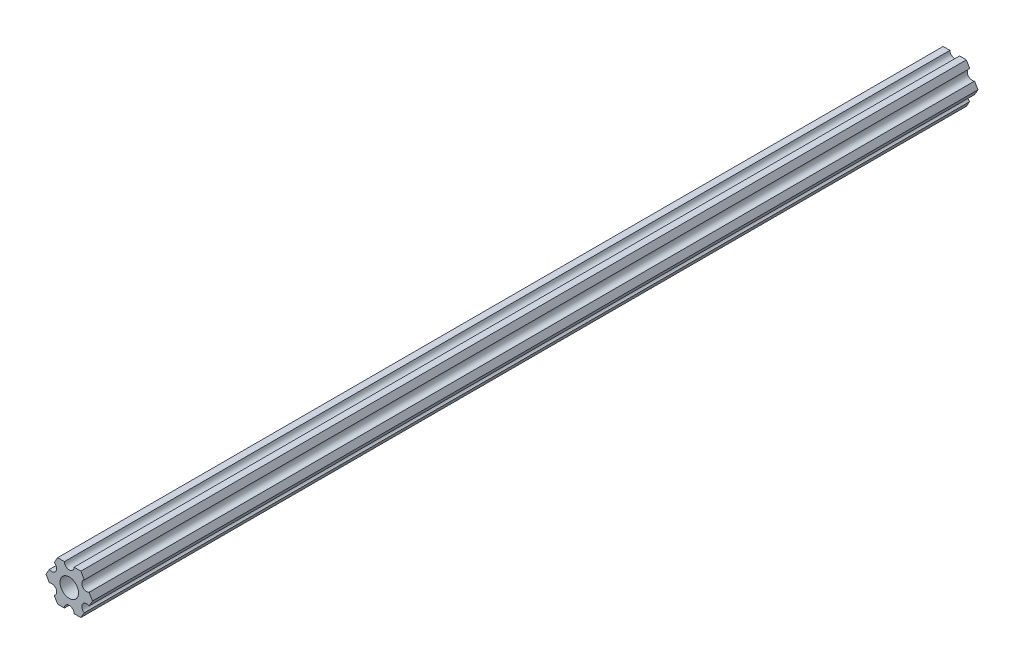
ISO-10303-21;
HEADER;
FILE_DESCRIPTION(('STEP AP214'),'2;1');
FILE_NAME('part.step','',(''),(''),'','','');
FILE_SCHEMA(('AUTOMOTIVE_DESIGN { 1 0 10303 214 1 1 1 1 }'));
ENDSEC;
DATA;
#1=APPLICATION_CONTEXT('core data for automotive mechanical design processes');
#2=APPLICATION_PROTOCOL_DEFINITION('international standard','automotive_design',2000,#1);
#3=PRODUCT_CONTEXT('',#1,'mechanical');
#4=PRODUCT('Part','Part','',(#3));
#5=PRODUCT_RELATED_PRODUCT_CATEGORY('part','',(#4));
#6=PRODUCT_DEFINITION_FORMATION('','',#4);
#7=PRODUCT_DEFINITION_CONTEXT('part definition',#1,'design');
#8=PRODUCT_DEFINITION('design','',#6,#7);
#9=PRODUCT_DEFINITION_SHAPE('','',#8);
#10=(LENGTH_UNIT() NAMED_UNIT(*) SI_UNIT(.MILLI.,.METRE.));
#11=(NAMED_UNIT(*) PLANE_ANGLE_UNIT() SI_UNIT($,.RADIAN.));
#12=(NAMED_UNIT(*) SI_UNIT($,.STERADIAN.) SOLID_ANGLE_UNIT());
#13=UNCERTAINTY_MEASURE_WITH_UNIT(LENGTH_MEASURE(1.E-05),#10,'distance_accuracy_value','');
#14=(GEOMETRIC_REPRESENTATION_CONTEXT(3) GLOBAL_UNCERTAINTY_ASSIGNED_CONTEXT((#13)) GLOBAL_UNIT_ASSIGNED_CONTEXT((#10,
#11,#12)) REPRESENTATION_CONTEXT('',''));
#15=CARTESIAN_POINT('',(0.,0.,0.));
#16=DIRECTION('',(0.,0.,1.));
#17=DIRECTION('',(1.,0.,0.));
#18=AXIS2_PLACEMENT_3D('',#15,#16,#17);
#19=CARTESIAN_POINT('',(7.33234841870792,0.,0.));
#20=DIRECTION('',(0.866025403784429,0.500000000000017,0.));
#21=DIRECTION('',(-0.500000000000017,0.866025403784429,0.));
#22=AXIS2_PLACEMENT_3D('',#19,#20,#21);
#23=PLANE('',#22);
#24=DIRECTION('',(-0.500000000000144,0.866025403784355,0.));
#25=VECTOR('',#24,1.);
#26=CARTESIAN_POINT('',(4.73726131403094,4.49482271536834,279.4));
#27=LINE('',#26,#25);
#28=CARTESIAN_POINT('',(4.73726131403131,4.4948227153677,279.4));
#29=VERTEX_POINT('',#28);
#30=CARTESIAN_POINT('',(3.66617420935396,6.35,279.4));
#31=VERTEX_POINT('',#30);
#32=EDGE_CURVE('E170',#29,#31,#27,.T.);
#33=ORIENTED_EDGE('',*,*,#32,.F.);
#34=DIRECTION('',(0.,0.,1.));
#35=VECTOR('',#34,1.);
#36=CARTESIAN_POINT('',(4.73726131403131,4.4948227153677,279.4));
#37=LINE('',#36,#35);
#38=CARTESIAN_POINT('',(4.73726131403131,4.4948227153677,0.));
#39=VERTEX_POINT('',#38);
#40=EDGE_CURVE('E125',#29,#39,#37,.F.);
#41=ORIENTED_EDGE('',*,*,#40,.T.);
#42=DIRECTION('',(-0.500000000000144,0.866025403784355,0.));
#43=VECTOR('',#42,1.);
#44=CARTESIAN_POINT('',(4.73726131403094,4.49482271536834,0.));
#45=LINE('',#44,#43);
#46=CARTESIAN_POINT('',(3.66617420935396,6.35,0.));
#47=VERTEX_POINT('',#46);
#48=EDGE_CURVE('E228',#39,#47,#45,.T.);
#49=ORIENTED_EDGE('',*,*,#48,.T.);
#50=DIRECTION('',(0.,0.,1.));
#51=VECTOR('',#50,1.);
#52=CARTESIAN_POINT('',(3.66617420935396,6.35,0.));
#53=LINE('',#52,#51);
#54=EDGE_CURVE('E132',#31,#47,#53,.F.);
#55=ORIENTED_EDGE('',*,*,#54,.F.);
#56=EDGE_LOOP('',(#33,#41,#49,#55));
#57=FACE_BOUND('',#56,.T.);
#58=ADVANCED_FACE('F17',(#57),#23,.T.);
#59=CARTESIAN_POINT('',(3.66617420935396,6.35,0.));
#60=DIRECTION('',(0.,1.,0.));
#61=DIRECTION('',(0.,0.,1.));
#62=AXIS2_PLACEMENT_3D('',#59,#60,#61);
#63=PLANE('',#62);
#64=DIRECTION('',(1.,0.,0.));
#65=VECTOR('',#64,1.);
#66=CARTESIAN_POINT('',(0.,6.35,0.));
#67=LINE('',#66,#65);
#68=CARTESIAN_POINT('',(1.524,6.35,0.));
#69=VERTEX_POINT('',#68);
#70=EDGE_CURVE('E226',#47,#69,#67,.F.);
#71=ORIENTED_EDGE('',*,*,#70,.T.);
#72=DIRECTION('',(0.,0.,1.));
#73=VECTOR('',#72,1.);
#74=CARTESIAN_POINT('',(1.524,6.35,279.4));
#75=LINE('',#74,#73);
#76=CARTESIAN_POINT('',(1.524,6.35,279.4));
#77=VERTEX_POINT('',#76);
#78=EDGE_CURVE('E275',#69,#77,#75,.T.);
#79=ORIENTED_EDGE('',*,*,#78,.T.);
#80=DIRECTION('',(1.,0.,0.));
#81=VECTOR('',#80,1.);
#82=CARTESIAN_POINT('',(0.,6.35,279.4));
#83=LINE('',#82,#81);
#84=EDGE_CURVE('E303',#31,#77,#83,.F.);
#85=ORIENTED_EDGE('',*,*,#84,.F.);
#86=ORIENTED_EDGE('',*,*,#54,.T.);
#87=EDGE_LOOP('',(#71,#79,#85,#86));
#88=FACE_BOUND('',#87,.T.);
#89=ADVANCED_FACE('F319',(#88),#63,.T.);
#90=CARTESIAN_POINT('',(0.,6.35,279.4));
#91=DIRECTION('',(0.,0.,1.));
#92=DIRECTION('',(1.,0.,0.));
#93=AXIS2_PLACEMENT_3D('',#90,#91,#92);
#94=CYLINDRICAL_SURFACE('',#93,1.524);
#95=CARTESIAN_POINT('',(0.,6.35,279.4));
#96=DIRECTION('',(0.,0.,1.));
#97=DIRECTION('',(1.,0.,0.));
#98=AXIS2_PLACEMENT_3D('',#95,#96,#97);
#99=CIRCLE('',#98,1.524);
#100=CARTESIAN_POINT('',(-1.524,6.35,279.4));
#101=VERTEX_POINT('',#100);
#102=EDGE_CURVE('E301',#77,#101,#99,.F.);
#103=ORIENTED_EDGE('',*,*,#102,.F.);
#104=ORIENTED_EDGE('',*,*,#78,.F.);
#105=CARTESIAN_POINT('',(0.,6.35,0.));
#106=DIRECTION('',(0.,0.,1.));
#107=DIRECTION('',(1.,0.,0.));
#108=AXIS2_PLACEMENT_3D('',#105,#106,#107);
#109=CIRCLE('',#108,1.524);
#110=CARTESIAN_POINT('',(-1.524,6.35,0.));
#111=VERTEX_POINT('',#110);
#112=EDGE_CURVE('E223',#69,#111,#109,.F.);
#113=ORIENTED_EDGE('',*,*,#112,.T.);
#114=DIRECTION('',(0.,0.,1.));
#115=VECTOR('',#114,1.);
#116=CARTESIAN_POINT('',(-1.524,6.35,0.));
#117=LINE('',#116,#115);
#118=EDGE_CURVE('E271',#101,#111,#117,.F.);
#119=ORIENTED_EDGE('',*,*,#118,.F.);
#120=EDGE_LOOP('',(#103,#104,#113,#119));
#121=FACE_BOUND('',#120,.T.);
#122=ADVANCED_FACE('F315',(#121),#94,.F.);
#123=CARTESIAN_POINT('',(3.66617420935396,6.35,0.));
#124=DIRECTION('',(0.,1.,0.));
#125=DIRECTION('',(0.,0.,1.));
#126=AXIS2_PLACEMENT_3D('',#123,#124,#125);
#127=PLANE('',#126);
#128=DIRECTION('',(1.,0.,0.));
#129=VECTOR('',#128,1.);
#130=CARTESIAN_POINT('',(0.,6.35,279.4));
#131=LINE('',#130,#129);
#132=CARTESIAN_POINT('',(-3.66617420935396,6.35,279.4));
#133=VERTEX_POINT('',#132);
#134=EDGE_CURVE('E302',#101,#133,#131,.F.);
#135=ORIENTED_EDGE('',*,*,#134,.F.);
#136=ORIENTED_EDGE('',*,*,#118,.T.);
#137=DIRECTION('',(1.,0.,0.));
#138=VECTOR('',#137,1.);
#139=CARTESIAN_POINT('',(0.,6.35,0.));
#140=LINE('',#139,#138);
#141=CARTESIAN_POINT('',(-3.66617420935396,6.35,0.));
#142=VERTEX_POINT('',#141);
#143=EDGE_CURVE('E218',#111,#142,#140,.F.);
#144=ORIENTED_EDGE('',*,*,#143,.T.);
#145=DIRECTION('',(0.,0.,1.));
#146=VECTOR('',#145,1.);
#147=CARTESIAN_POINT('',(-3.66617420935396,6.35,0.));
#148=LINE('',#147,#146);
#149=EDGE_CURVE('E269',#133,#142,#148,.F.);
#150=ORIENTED_EDGE('',*,*,#149,.F.);
#151=EDGE_LOOP('',(#135,#136,#144,#150));
#152=FACE_BOUND('',#151,.T.);
#153=ADVANCED_FACE('F408',(#152),#127,.T.);
#154=CARTESIAN_POINT('',(-3.66617420935396,6.35,0.));
#155=DIRECTION('',(-0.866025403784429,0.500000000000017,0.));
#156=DIRECTION('',(-0.500000000000017,-0.866025403784429,0.));
#157=AXIS2_PLACEMENT_3D('',#154,#155,#156);
#158=PLANE('',#157);
#159=DIRECTION('',(-0.500000000000144,-0.866025403784355,0.));
#160=VECTOR('',#159,1.);
#161=CARTESIAN_POINT('',(-3.66617420935396,6.35,0.));
#162=LINE('',#161,#160);
#163=CARTESIAN_POINT('',(-4.73726131403131,4.4948227153677,0.));
#164=VERTEX_POINT('',#163);
#165=EDGE_CURVE('E215',#142,#164,#162,.T.);
#166=ORIENTED_EDGE('',*,*,#165,.T.);
#167=DIRECTION('',(0.,0.,1.));
#168=VECTOR('',#167,1.);
#169=CARTESIAN_POINT('',(-4.73726131403131,4.4948227153677,279.4));
#170=LINE('',#169,#168);
#171=CARTESIAN_POINT('',(-4.73726131403131,4.4948227153677,279.4));
#172=VERTEX_POINT('',#171);
#173=EDGE_CURVE('E266',#164,#172,#170,.T.);
#174=ORIENTED_EDGE('',*,*,#173,.T.);
#175=DIRECTION('',(-0.500000000000144,-0.866025403784355,0.));
#176=VECTOR('',#175,1.);
#177=CARTESIAN_POINT('',(-3.66617420935396,6.35,279.4));
#178=LINE('',#177,#176);
#179=EDGE_CURVE('E300',#133,#172,#178,.T.);
#180=ORIENTED_EDGE('',*,*,#179,.F.);
#181=ORIENTED_EDGE('',*,*,#149,.T.);
#182=EDGE_LOOP('',(#166,#174,#180,#181));
#183=FACE_BOUND('',#182,.T.);
#184=ADVANCED_FACE('F406',(#183),#158,.T.);
#185=CARTESIAN_POINT('',(-5.49926131403094,3.175,279.4));
#186=DIRECTION('',(0.,0.,1.));
#187=DIRECTION('',(1.,0.,0.));
#188=AXIS2_PLACEMENT_3D('',#185,#186,#187);
#189=CYLINDRICAL_SURFACE('',#188,1.524);
#190=CARTESIAN_POINT('',(-5.49926131403094,3.175,279.4));
#191=DIRECTION('',(0.,0.,1.));
#192=DIRECTION('',(1.,0.,0.));
#193=AXIS2_PLACEMENT_3D('',#190,#191,#192);
#194=CIRCLE('',#193,1.524);
#195=CARTESIAN_POINT('',(-6.26126131403101,1.85517728463251,279.4));
#196=VERTEX_POINT('',#195);
#197=EDGE_CURVE('E297',#172,#196,#194,.F.);
#198=ORIENTED_EDGE('',*,*,#197,.F.);
#199=ORIENTED_EDGE('',*,*,#173,.F.);
#200=CARTESIAN_POINT('',(-5.49926131403094,3.175,0.));
#201=DIRECTION('',(0.,0.,1.));
#202=DIRECTION('',(1.,0.,0.));
#203=AXIS2_PLACEMENT_3D('',#200,#201,#202);
#204=CIRCLE('',#203,1.524);
#205=CARTESIAN_POINT('',(-6.26126131403101,1.85517728463251,0.));
#206=VERTEX_POINT('',#205);
#207=EDGE_CURVE('E212',#164,#206,#204,.F.);
#208=ORIENTED_EDGE('',*,*,#207,.T.);
#209=DIRECTION('',(0.,0.,1.));
#210=VECTOR('',#209,1.);
#211=CARTESIAN_POINT('',(-6.26126131403113,1.85517728463253,0.));
#212=LINE('',#211,#210);
#213=EDGE_CURVE('E262',#196,#206,#212,.F.);
#214=ORIENTED_EDGE('',*,*,#213,.F.);
#215=EDGE_LOOP('',(#198,#199,#208,#214));
#216=FACE_BOUND('',#215,.T.);
#217=ADVANCED_FACE('F403',(#216),#189,.F.);
#218=CARTESIAN_POINT('',(-3.66617420935396,6.35,0.));
#219=DIRECTION('',(-0.866025403784429,0.500000000000017,0.));
#220=DIRECTION('',(-0.500000000000017,-0.866025403784429,0.));
#221=AXIS2_PLACEMENT_3D('',#218,#219,#220);
#222=PLANE('',#221);
#223=DIRECTION('',(-0.49999999999999,-0.866025403784444,0.));
#224=VECTOR('',#223,1.);
#225=CARTESIAN_POINT('',(-6.26126131403094,1.85517728463242,279.4));
#226=LINE('',#225,#224);
#227=CARTESIAN_POINT('',(-7.33234841870792,0.,279.4));
#228=VERTEX_POINT('',#227);
#229=EDGE_CURVE('E299',#196,#228,#226,.T.);
#230=ORIENTED_EDGE('',*,*,#229,.F.);
#231=ORIENTED_EDGE('',*,*,#213,.T.);
#232=DIRECTION('',(-0.49999999999999,-0.866025403784444,0.));
#233=VECTOR('',#232,1.);
#234=CARTESIAN_POINT('',(-6.26126131403094,1.85517728463242,0.));
#235=LINE('',#234,#233);
#236=CARTESIAN_POINT('',(-7.33234841870792,0.,0.));
#237=VERTEX_POINT('',#236);
#238=EDGE_CURVE('E207',#206,#237,#235,.T.);
#239=ORIENTED_EDGE('',*,*,#238,.T.);
#240=DIRECTION('',(0.,0.,1.));
#241=VECTOR('',#240,1.);
#242=CARTESIAN_POINT('',(-7.33234841870792,0.,0.));
#243=LINE('',#242,#241);
#244=EDGE_CURVE('E260',#228,#237,#243,.F.);
#245=ORIENTED_EDGE('',*,*,#244,.F.);
#246=EDGE_LOOP('',(#230,#231,#239,#245));
#247=FACE_BOUND('',#246,.T.);
#248=ADVANCED_FACE('F398',(#247),#222,.T.);
#249=CARTESIAN_POINT('',(-7.33234841870792,0.,0.));
#250=DIRECTION('',(-0.866025403784429,-0.500000000000017,0.));
#251=DIRECTION('',(0.500000000000017,-0.866025403784429,0.));
#252=AXIS2_PLACEMENT_3D('',#249,#250,#251);
#253=PLANE('',#252);
#254=DIRECTION('',(0.49999999999999,-0.866025403784444,0.));
#255=VECTOR('',#254,1.);
#256=CARTESIAN_POINT('',(-7.33234841870792,0.,0.));
#257=LINE('',#256,#255);
#258=CARTESIAN_POINT('',(-6.2612613140309,-1.85517728463249,0.));
#259=VERTEX_POINT('',#258);
#260=EDGE_CURVE('E204',#237,#259,#257,.T.);
#261=ORIENTED_EDGE('',*,*,#260,.T.);
#262=DIRECTION('',(0.,0.,1.));
#263=VECTOR('',#262,1.);
#264=CARTESIAN_POINT('',(-6.2612613140309,-1.85517728463249,279.4));
#265=LINE('',#264,#263);
#266=CARTESIAN_POINT('',(-6.2612613140309,-1.85517728463249,279.4));
#267=VERTEX_POINT('',#266);
#268=EDGE_CURVE('E257',#259,#267,#265,.T.);
#269=ORIENTED_EDGE('',*,*,#268,.T.);
#270=DIRECTION('',(0.49999999999999,-0.866025403784444,0.));
#271=VECTOR('',#270,1.);
#272=CARTESIAN_POINT('',(-7.33234841870792,0.,279.4));
#273=LINE('',#272,#271);
#274=EDGE_CURVE('E296',#228,#267,#273,.T.);
#275=ORIENTED_EDGE('',*,*,#274,.F.);
#276=ORIENTED_EDGE('',*,*,#244,.T.);
#277=EDGE_LOOP('',(#261,#269,#275,#276));
#278=FACE_BOUND('',#277,.T.);
#279=ADVANCED_FACE('F393',(#278),#253,.T.);
#280=CARTESIAN_POINT('',(-5.49926131403094,-3.175,279.4));
#281=DIRECTION('',(0.,0.,1.));
#282=DIRECTION('',(1.,0.,0.));
#283=AXIS2_PLACEMENT_3D('',#280,#281,#282);
#284=CYLINDRICAL_SURFACE('',#283,1.524);
#285=CARTESIAN_POINT('',(-5.49926131403094,-3.175,279.4));
#286=DIRECTION('',(0.,0.,1.));
#287=DIRECTION('',(1.,0.,0.));
#288=AXIS2_PLACEMENT_3D('',#285,#286,#287);
#289=CIRCLE('',#288,1.524);
#290=CARTESIAN_POINT('',(-4.73726131403087,-4.49482271536787,279.4));
#291=VERTEX_POINT('',#290);
#292=EDGE_CURVE('E293',#267,#291,#289,.F.);
#293=ORIENTED_EDGE('',*,*,#292,.F.);
#294=ORIENTED_EDGE('',*,*,#268,.F.);
#295=CARTESIAN_POINT('',(-5.49926131403094,-3.175,0.));
#296=DIRECTION('',(0.,0.,1.));
#297=DIRECTION('',(1.,0.,0.));
#298=AXIS2_PLACEMENT_3D('',#295,#296,#297);
#299=CIRCLE('',#298,1.524);
#300=CARTESIAN_POINT('',(-4.73726131403087,-4.49482271536787,0.));
#301=VERTEX_POINT('',#300);
#302=EDGE_CURVE('E201',#259,#301,#299,.F.);
#303=ORIENTED_EDGE('',*,*,#302,.T.);
#304=DIRECTION('',(0.,0.,1.));
#305=VECTOR('',#304,1.);
#306=CARTESIAN_POINT('',(-4.73726131403042,-4.49482271536804,0.));
#307=LINE('',#306,#305);
#308=EDGE_CURVE('E253',#291,#301,#307,.F.);
#309=ORIENTED_EDGE('',*,*,#308,.F.);
#310=EDGE_LOOP('',(#293,#294,#303,#309));
#311=FACE_BOUND('',#310,.T.);
#312=ADVANCED_FACE('F389',(#311),#284,.F.);
#313=CARTESIAN_POINT('',(-7.33234841870792,0.,0.));
#314=DIRECTION('',(-0.866025403784429,-0.500000000000017,0.));
#315=DIRECTION('',(0.500000000000017,-0.866025403784429,0.));
#316=AXIS2_PLACEMENT_3D('',#313,#314,#315);
#317=PLANE('',#316);
#318=DIRECTION('',(0.500000000000144,-0.866025403784355,0.));
#319=VECTOR('',#318,1.);
#320=CARTESIAN_POINT('',(-4.73726131403094,-4.49482271536834,279.4));
#321=LINE('',#320,#319);
#322=CARTESIAN_POINT('',(-3.66617420935396,-6.35,279.4));
#323=VERTEX_POINT('',#322);
#324=EDGE_CURVE('E295',#291,#323,#321,.T.);
#325=ORIENTED_EDGE('',*,*,#324,.F.);
#326=ORIENTED_EDGE('',*,*,#308,.T.);
#327=DIRECTION('',(0.500000000000144,-0.866025403784355,0.));
#328=VECTOR('',#327,1.);
#329=CARTESIAN_POINT('',(-4.73726131403094,-4.49482271536834,0.));
#330=LINE('',#329,#328);
#331=CARTESIAN_POINT('',(-3.66617420935396,-6.35,0.));
#332=VERTEX_POINT('',#331);
#333=EDGE_CURVE('E196',#301,#332,#330,.T.);
#334=ORIENTED_EDGE('',*,*,#333,.T.);
#335=DIRECTION('',(0.,0.,-1.));
#336=VECTOR('',#335,1.);
#337=CARTESIAN_POINT('',(-3.66617420935396,-6.35,0.));
#338=LINE('',#337,#336);
#339=EDGE_CURVE('E251',#323,#332,#338,.T.);
#340=ORIENTED_EDGE('',*,*,#339,.F.);
#341=EDGE_LOOP('',(#325,#326,#334,#340));
#342=FACE_BOUND('',#341,.T.);
#343=ADVANCED_FACE('F385',(#342),#317,.T.);
#344=CARTESIAN_POINT('',(-3.66617420935396,-6.35,0.));
#345=DIRECTION('',(0.,-1.,0.));
#346=DIRECTION('',(0.,0.,-1.));
#347=AXIS2_PLACEMENT_3D('',#344,#345,#346);
#348=PLANE('',#347);
#349=DIRECTION('',(1.,0.,0.));
#350=VECTOR('',#349,1.);
#351=CARTESIAN_POINT('',(0.,-6.35,0.));
#352=LINE('',#351,#350);
#353=CARTESIAN_POINT('',(-1.524,-6.35,0.));
#354=VERTEX_POINT('',#353);
#355=EDGE_CURVE('E193',#332,#354,#352,.T.);
#356=ORIENTED_EDGE('',*,*,#355,.T.);
#357=DIRECTION('',(0.,0.,1.));
#358=VECTOR('',#357,1.);
#359=CARTESIAN_POINT('',(-1.524,-6.35,279.4));
#360=LINE('',#359,#358);
#361=CARTESIAN_POINT('',(-1.524,-6.35,279.4));
#362=VERTEX_POINT('',#361);
#363=EDGE_CURVE('E248',#354,#362,#360,.T.);
#364=ORIENTED_EDGE('',*,*,#363,.T.);
#365=DIRECTION('',(1.,0.,0.));
#366=VECTOR('',#365,1.);
#367=CARTESIAN_POINT('',(0.,-6.35,279.4));
#368=LINE('',#367,#366);
#369=EDGE_CURVE('E292',#323,#362,#368,.T.);
#370=ORIENTED_EDGE('',*,*,#369,.F.);
#371=ORIENTED_EDGE('',*,*,#339,.T.);
#372=EDGE_LOOP('',(#356,#364,#370,#371));
#373=FACE_BOUND('',#372,.T.);
#374=ADVANCED_FACE('F379',(#373),#348,.T.);
#375=CARTESIAN_POINT('',(0.,-6.35,279.4));
#376=DIRECTION('',(0.,0.,1.));
#377=DIRECTION('',(1.,0.,0.));
#378=AXIS2_PLACEMENT_3D('',#375,#376,#377);
#379=CYLINDRICAL_SURFACE('',#378,1.524);
#380=CARTESIAN_POINT('',(0.,-6.35,279.4));
#381=DIRECTION('',(0.,0.,1.));
#382=DIRECTION('',(1.,0.,0.));
#383=AXIS2_PLACEMENT_3D('',#380,#381,#382);
#384=CIRCLE('',#383,1.524);
#385=CARTESIAN_POINT('',(1.524,-6.35,279.4));
#386=VERTEX_POINT('',#385);
#387=EDGE_CURVE('E289',#362,#386,#384,.F.);
#388=ORIENTED_EDGE('',*,*,#387,.F.);
#389=ORIENTED_EDGE('',*,*,#363,.F.);
#390=CARTESIAN_POINT('',(0.,-6.35,0.));
#391=DIRECTION('',(0.,0.,1.));
#392=DIRECTION('',(1.,0.,0.));
#393=AXIS2_PLACEMENT_3D('',#390,#391,#392);
#394=CIRCLE('',#393,1.524);
#395=CARTESIAN_POINT('',(1.524,-6.35,0.));
#396=VERTEX_POINT('',#395);
#397=EDGE_CURVE('E190',#354,#396,#394,.F.);
#398=ORIENTED_EDGE('',*,*,#397,.T.);
#399=DIRECTION('',(0.,0.,-1.));
#400=VECTOR('',#399,1.);
#401=CARTESIAN_POINT('',(1.524,-6.35,0.));
#402=LINE('',#401,#400);
#403=EDGE_CURVE('E244',#386,#396,#402,.T.);
#404=ORIENTED_EDGE('',*,*,#403,.F.);
#405=EDGE_LOOP('',(#388,#389,#398,#404));
#406=FACE_BOUND('',#405,.T.);
#407=ADVANCED_FACE('F376',(#406),#379,.F.);
#408=CARTESIAN_POINT('',(-3.66617420935396,-6.35,0.));
#409=DIRECTION('',(0.,-1.,0.));
#410=DIRECTION('',(0.,0.,-1.));
#411=AXIS2_PLACEMENT_3D('',#408,#409,#410);
#412=PLANE('',#411);
#413=DIRECTION('',(1.,0.,0.));
#414=VECTOR('',#413,1.);
#415=CARTESIAN_POINT('',(0.,-6.35,279.4));
#416=LINE('',#415,#414);
#417=CARTESIAN_POINT('',(3.66617420935396,-6.35,279.4));
#418=VERTEX_POINT('',#417);
#419=EDGE_CURVE('E291',#386,#418,#416,.T.);
#420=ORIENTED_EDGE('',*,*,#419,.F.);
#421=ORIENTED_EDGE('',*,*,#403,.T.);
#422=DIRECTION('',(1.,0.,0.));
#423=VECTOR('',#422,1.);
#424=CARTESIAN_POINT('',(0.,-6.35,0.));
#425=LINE('',#424,#423);
#426=CARTESIAN_POINT('',(3.66617420935396,-6.35,0.));
#427=VERTEX_POINT('',#426);
#428=EDGE_CURVE('E185',#396,#427,#425,.T.);
#429=ORIENTED_EDGE('',*,*,#428,.T.);
#430=DIRECTION('',(0.,0.,1.));
#431=VECTOR('',#430,1.);
#432=CARTESIAN_POINT('',(3.66617420935396,-6.35,0.));
#433=LINE('',#432,#431);
#434=EDGE_CURVE('E242',#418,#427,#433,.F.);
#435=ORIENTED_EDGE('',*,*,#434,.F.);
#436=EDGE_LOOP('',(#420,#421,#429,#435));
#437=FACE_BOUND('',#436,.T.);
#438=ADVANCED_FACE('F370',(#437),#412,.T.);
#439=CARTESIAN_POINT('',(3.66617420935396,-6.35,0.));
#440=DIRECTION('',(0.866025403784429,-0.500000000000017,0.));
#441=DIRECTION('',(0.500000000000017,0.866025403784429,0.));
#442=AXIS2_PLACEMENT_3D('',#439,#440,#441);
#443=PLANE('',#442);
#444=DIRECTION('',(0.500000000000144,0.866025403784355,0.));
#445=VECTOR('',#444,1.);
#446=CARTESIAN_POINT('',(3.66617420935396,-6.35,0.));
#447=LINE('',#446,#445);
#448=CARTESIAN_POINT('',(4.73726131403131,-4.4948227153677,0.));
#449=VERTEX_POINT('',#448);
#450=EDGE_CURVE('E176',#427,#449,#447,.T.);
#451=ORIENTED_EDGE('',*,*,#450,.T.);
#452=DIRECTION('',(0.,0.,1.));
#453=VECTOR('',#452,1.);
#454=CARTESIAN_POINT('',(4.73726131403131,-4.4948227153677,279.4));
#455=LINE('',#454,#453);
#456=CARTESIAN_POINT('',(4.73726131403131,-4.4948227153677,279.4));
#457=VERTEX_POINT('',#456);
#458=EDGE_CURVE('E239',#449,#457,#455,.T.);
#459=ORIENTED_EDGE('',*,*,#458,.T.);
#460=DIRECTION('',(0.500000000000144,0.866025403784355,0.));
#461=VECTOR('',#460,1.);
#462=CARTESIAN_POINT('',(3.66617420935396,-6.35,279.4));
#463=LINE('',#462,#461);
#464=EDGE_CURVE('E288',#418,#457,#463,.T.);
#465=ORIENTED_EDGE('',*,*,#464,.F.);
#466=ORIENTED_EDGE('',*,*,#434,.T.);
#467=EDGE_LOOP('',(#451,#459,#465,#466));
#468=FACE_BOUND('',#467,.T.);
#469=ADVANCED_FACE('F366',(#468),#443,.T.);
#470=CARTESIAN_POINT('',(5.49926131403094,-3.175,279.4));
#471=DIRECTION('',(0.,0.,1.));
#472=DIRECTION('',(1.,0.,0.));
#473=AXIS2_PLACEMENT_3D('',#470,#471,#472);
#474=CYLINDRICAL_SURFACE('',#473,1.524);
#475=CARTESIAN_POINT('',(5.49926131403094,-3.175,279.4));
#476=DIRECTION('',(0.,0.,1.));
#477=DIRECTION('',(1.,0.,0.));
#478=AXIS2_PLACEMENT_3D('',#475,#476,#477);
#479=CIRCLE('',#478,1.524);
#480=CARTESIAN_POINT('',(6.26126131403101,-1.85517728463251,279.4));
#481=VERTEX_POINT('',#480);
#482=EDGE_CURVE('E285',#457,#481,#479,.F.);
#483=ORIENTED_EDGE('',*,*,#482,.F.);
#484=ORIENTED_EDGE('',*,*,#458,.F.);
#485=CARTESIAN_POINT('',(5.49926131403094,-3.175,0.));
#486=DIRECTION('',(0.,0.,1.));
#487=DIRECTION('',(1.,0.,0.));
#488=AXIS2_PLACEMENT_3D('',#485,#486,#487);
#489=CIRCLE('',#488,1.524);
#490=CARTESIAN_POINT('',(6.26126131403101,-1.85517728463251,0.));
#491=VERTEX_POINT('',#490);
#492=EDGE_CURVE('E174',#449,#491,#489,.F.);
#493=ORIENTED_EDGE('',*,*,#492,.T.);
#494=DIRECTION('',(0.,0.,1.));
#495=VECTOR('',#494,1.);
#496=CARTESIAN_POINT('',(6.26126131403113,-1.85517728463253,0.));
#497=LINE('',#496,#495);
#498=EDGE_CURVE('E162',#481,#491,#497,.F.);
#499=ORIENTED_EDGE('',*,*,#498,.F.);
#500=EDGE_LOOP('',(#483,#484,#493,#499));
#501=FACE_BOUND('',#500,.T.);
#502=ADVANCED_FACE('F362',(#501),#474,.F.);
#503=CARTESIAN_POINT('',(3.66617420935396,-6.35,0.));
#504=DIRECTION('',(0.866025403784429,-0.500000000000017,0.));
#505=DIRECTION('',(0.500000000000017,0.866025403784429,0.));
#506=AXIS2_PLACEMENT_3D('',#503,#504,#505);
#507=PLANE('',#506);
#508=DIRECTION('',(0.49999999999999,0.866025403784444,0.));
#509=VECTOR('',#508,1.);
#510=CARTESIAN_POINT('',(6.26126131403094,-1.85517728463242,279.4));
#511=LINE('',#510,#509);
#512=CARTESIAN_POINT('',(7.33234841870792,0.,279.4));
#513=VERTEX_POINT('',#512);
#514=EDGE_CURVE('E287',#481,#513,#511,.T.);
#515=ORIENTED_EDGE('',*,*,#514,.F.);
#516=ORIENTED_EDGE('',*,*,#498,.T.);
#517=DIRECTION('',(0.49999999999999,0.866025403784444,0.));
#518=VECTOR('',#517,1.);
#519=CARTESIAN_POINT('',(6.26126131403094,-1.85517728463242,0.));
#520=LINE('',#519,#518);
#521=CARTESIAN_POINT('',(7.33234841870792,0.,0.));
#522=VERTEX_POINT('',#521);
#523=EDGE_CURVE('E168',#491,#522,#520,.T.);
#524=ORIENTED_EDGE('',*,*,#523,.T.);
#525=DIRECTION('',(0.,0.,1.));
#526=VECTOR('',#525,1.);
#527=CARTESIAN_POINT('',(7.33234841870792,0.,0.));
#528=LINE('',#527,#526);
#529=EDGE_CURVE('E155',#513,#522,#528,.F.);
#530=ORIENTED_EDGE('',*,*,#529,.F.);
#531=EDGE_LOOP('',(#515,#516,#524,#530));
#532=FACE_BOUND('',#531,.T.);
#533=ADVANCED_FACE('F172',(#532),#507,.T.);
#534=CARTESIAN_POINT('',(7.33234841870792,0.,0.));
#535=DIRECTION('',(0.866025403784429,0.500000000000017,0.));
#536=DIRECTION('',(-0.500000000000017,0.866025403784429,0.));
#537=AXIS2_PLACEMENT_3D('',#534,#535,#536);
#538=PLANE('',#537);
#539=DIRECTION('',(-0.49999999999999,0.866025403784444,0.));
#540=VECTOR('',#539,1.);
#541=CARTESIAN_POINT('',(7.33234841870792,0.,0.));
#542=LINE('',#541,#540);
#543=CARTESIAN_POINT('',(6.2612613140309,1.85517728463249,0.));
#544=VERTEX_POINT('',#543);
#545=EDGE_CURVE('E158',#522,#544,#542,.T.);
#546=ORIENTED_EDGE('',*,*,#545,.T.);
#547=DIRECTION('',(0.,0.,1.));
#548=VECTOR('',#547,1.);
#549=CARTESIAN_POINT('',(6.2612613140309,1.85517728463249,279.4));
#550=LINE('',#549,#548);
#551=CARTESIAN_POINT('',(6.2612613140309,1.85517728463249,279.4));
#552=VERTEX_POINT('',#551);
#553=EDGE_CURVE('E119',#544,#552,#550,.T.);
#554=ORIENTED_EDGE('',*,*,#553,.T.);
#555=DIRECTION('',(-0.49999999999999,0.866025403784444,0.));
#556=VECTOR('',#555,1.);
#557=CARTESIAN_POINT('',(7.33234841870792,0.,279.4));
#558=LINE('',#557,#556);
#559=EDGE_CURVE('E35',#513,#552,#558,.T.);
#560=ORIENTED_EDGE('',*,*,#559,.F.);
#561=ORIENTED_EDGE('',*,*,#529,.T.);
#562=EDGE_LOOP('',(#546,#554,#560,#561));
#563=FACE_BOUND('',#562,.T.);
#564=ADVANCED_FACE('F157',(#563),#538,.T.);
#565=CARTESIAN_POINT('',(5.49926131403094,3.175,279.4));
#566=DIRECTION('',(0.,0.,1.));
#567=DIRECTION('',(1.,0.,0.));
#568=AXIS2_PLACEMENT_3D('',#565,#566,#567);
#569=CYLINDRICAL_SURFACE('',#568,1.524);
#570=CARTESIAN_POINT('',(5.49926131403094,3.175,279.4));
#571=DIRECTION('',(0.,0.,1.));
#572=DIRECTION('',(1.,0.,0.));
#573=AXIS2_PLACEMENT_3D('',#570,#571,#572);
#574=CIRCLE('',#573,1.524);
#575=EDGE_CURVE('E283',#552,#29,#574,.F.);
#576=ORIENTED_EDGE('',*,*,#575,.F.);
#577=ORIENTED_EDGE('',*,*,#553,.F.);
#578=CARTESIAN_POINT('',(5.49926131403094,3.175,0.));
#579=DIRECTION('',(0.,0.,1.));
#580=DIRECTION('',(1.,0.,0.));
#581=AXIS2_PLACEMENT_3D('',#578,#579,#580);
#582=CIRCLE('',#581,1.524);
#583=EDGE_CURVE('E20',#544,#39,#582,.F.);
#584=ORIENTED_EDGE('',*,*,#583,.T.);
#585=ORIENTED_EDGE('',*,*,#40,.F.);
#586=EDGE_LOOP('',(#576,#577,#584,#585));
#587=FACE_BOUND('',#586,.T.);
#588=ADVANCED_FACE('F432',(#587),#569,.F.);
#589=CARTESIAN_POINT('',(0.,0.,0.));
#590=DIRECTION('',(0.,0.,1.));
#591=DIRECTION('',(1.,0.,0.));
#592=AXIS2_PLACEMENT_3D('',#589,#590,#591);
#593=PLANE('',#592);
#594=CARTESIAN_POINT('',(0.,0.,0.));
#595=DIRECTION('',(0.,0.,1.));
#596=DIRECTION('',(1.,0.,0.));
#597=AXIS2_PLACEMENT_3D('',#594,#595,#596);
#598=CIRCLE('',#597,2.9337);
#599=CARTESIAN_POINT('',(2.9337,0.,0.));
#600=VERTEX_POINT('',#599);
#601=EDGE_CURVE('E26',#600,#600,#598,.T.);
#602=ORIENTED_EDGE('',*,*,#601,.T.);
#603=EDGE_LOOP('',(#602));
#604=FACE_BOUND('',#603,.T.);
#605=ORIENTED_EDGE('',*,*,#523,.F.);
#606=ORIENTED_EDGE('',*,*,#492,.F.);
#607=ORIENTED_EDGE('',*,*,#450,.F.);
#608=ORIENTED_EDGE('',*,*,#428,.F.);
#609=ORIENTED_EDGE('',*,*,#397,.F.);
#610=ORIENTED_EDGE('',*,*,#355,.F.);
#611=ORIENTED_EDGE('',*,*,#333,.F.);
#612=ORIENTED_EDGE('',*,*,#302,.F.);
#613=ORIENTED_EDGE('',*,*,#260,.F.);
#614=ORIENTED_EDGE('',*,*,#238,.F.);
#615=ORIENTED_EDGE('',*,*,#207,.F.);
#616=ORIENTED_EDGE('',*,*,#165,.F.);
#617=ORIENTED_EDGE('',*,*,#143,.F.);
#618=ORIENTED_EDGE('',*,*,#112,.F.);
#619=ORIENTED_EDGE('',*,*,#70,.F.);
#620=ORIENTED_EDGE('',*,*,#48,.F.);
#621=ORIENTED_EDGE('',*,*,#583,.F.);
#622=ORIENTED_EDGE('',*,*,#545,.F.);
#623=EDGE_LOOP('',(#605,#606,#607,#608,#609,#610,#611,#612,#613,#614,#615,#616,#617,#618,#619,
#620,#621,#622));
#624=FACE_BOUND('',#623,.T.);
#625=ADVANCED_FACE('F166',(#604,#624),#593,.F.);
#626=CARTESIAN_POINT('',(0.,0.,279.4));
#627=DIRECTION('',(0.,0.,1.));
#628=DIRECTION('',(1.,0.,0.));
#629=AXIS2_PLACEMENT_3D('',#626,#627,#628);
#630=PLANE('',#629);
#631=CARTESIAN_POINT('',(0.,0.,279.4));
#632=DIRECTION('',(0.,0.,1.));
#633=DIRECTION('',(1.,0.,0.));
#634=AXIS2_PLACEMENT_3D('',#631,#632,#633);
#635=CIRCLE('',#634,2.9337);
#636=CARTESIAN_POINT('',(2.9337,0.,279.4));
#637=VERTEX_POINT('',#636);
#638=EDGE_CURVE('E11',#637,#637,#635,.F.);
#639=ORIENTED_EDGE('',*,*,#638,.T.);
#640=EDGE_LOOP('',(#639));
#641=FACE_BOUND('',#640,.T.);
#642=ORIENTED_EDGE('',*,*,#559,.T.);
#643=ORIENTED_EDGE('',*,*,#575,.T.);
#644=ORIENTED_EDGE('',*,*,#32,.T.);
#645=ORIENTED_EDGE('',*,*,#84,.T.);
#646=ORIENTED_EDGE('',*,*,#102,.T.);
#647=ORIENTED_EDGE('',*,*,#134,.T.);
#648=ORIENTED_EDGE('',*,*,#179,.T.);
#649=ORIENTED_EDGE('',*,*,#197,.T.);
#650=ORIENTED_EDGE('',*,*,#229,.T.);
#651=ORIENTED_EDGE('',*,*,#274,.T.);
#652=ORIENTED_EDGE('',*,*,#292,.T.);
#653=ORIENTED_EDGE('',*,*,#324,.T.);
#654=ORIENTED_EDGE('',*,*,#369,.T.);
#655=ORIENTED_EDGE('',*,*,#387,.T.);
#656=ORIENTED_EDGE('',*,*,#419,.T.);
#657=ORIENTED_EDGE('',*,*,#464,.T.);
#658=ORIENTED_EDGE('',*,*,#482,.T.);
#659=ORIENTED_EDGE('',*,*,#514,.T.);
#660=EDGE_LOOP('',(#642,#643,#644,#645,#646,#647,#648,#649,#650,#651,#652,#653,#654,#655,#656,
#657,#658,#659));
#661=FACE_BOUND('',#660,.T.);
#662=ADVANCED_FACE('F320',(#641,#661),#630,.T.);
#663=CARTESIAN_POINT('',(0.,0.,0.));
#664=DIRECTION('',(0.,0.,1.));
#665=DIRECTION('',(1.,0.,0.));
#666=AXIS2_PLACEMENT_3D('',#663,#664,#665);
#667=CYLINDRICAL_SURFACE('',#666,2.9337);
#668=ORIENTED_EDGE('',*,*,#638,.F.);
#669=EDGE_LOOP('',(#668));
#670=FACE_BOUND('',#669,.T.);
#671=ORIENTED_EDGE('',*,*,#601,.F.);
#672=EDGE_LOOP('',(#671));
#673=FACE_BOUND('',#672,.T.);
#674=ADVANCED_FACE('F418',(#670,#673),#667,.F.);
#675=CLOSED_SHELL('',(#58,#89,#122,#153,#184,#217,#248,#279,#312,#343,#374,#407,#438,#469,#502,
#533,#564,#588,#625,#662,#674));
#676=MANIFOLD_SOLID_BREP('B1',#675);
#677=ADVANCED_BREP_SHAPE_REPRESENTATION('',(#18,#676),#14);
#678=SHAPE_DEFINITION_REPRESENTATION(#9,#677);
ENDSEC;
END-ISO-10303-21;
